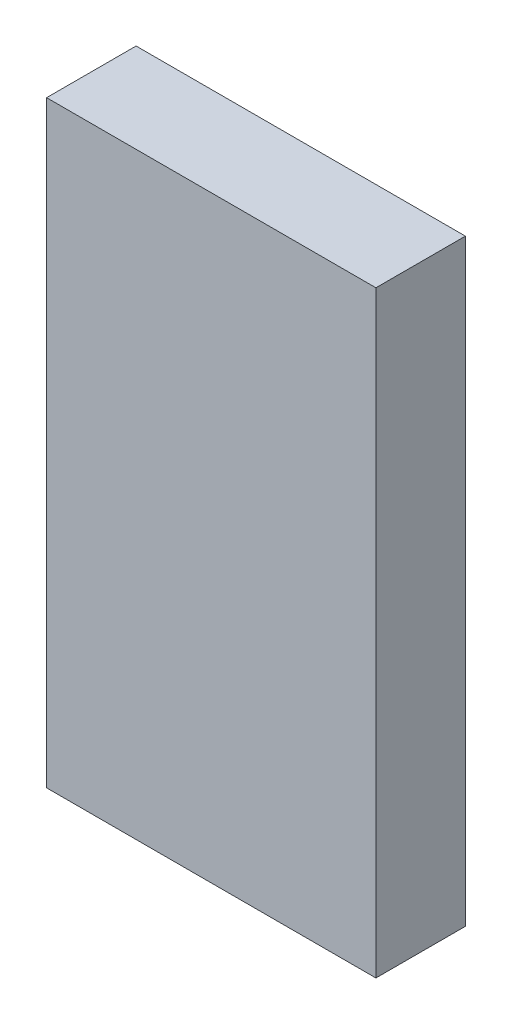
ISO-10303-21;
HEADER;
FILE_DESCRIPTION(('STEP AP214'),'2;1');
FILE_NAME('part.step','',(''),(''),'','','');
FILE_SCHEMA(('AUTOMOTIVE_DESIGN { 1 0 10303 214 1 1 1 1 }'));
ENDSEC;
DATA;
#1=APPLICATION_CONTEXT('core data for automotive mechanical design processes');
#2=APPLICATION_PROTOCOL_DEFINITION('international standard','automotive_design',2000,#1);
#3=PRODUCT_CONTEXT('',#1,'mechanical');
#4=PRODUCT('Part','Part','',(#3));
#5=PRODUCT_RELATED_PRODUCT_CATEGORY('part','',(#4));
#6=PRODUCT_DEFINITION_FORMATION('','',#4);
#7=PRODUCT_DEFINITION_CONTEXT('part definition',#1,'design');
#8=PRODUCT_DEFINITION('design','',#6,#7);
#9=PRODUCT_DEFINITION_SHAPE('','',#8);
#10=(LENGTH_UNIT() NAMED_UNIT(*) SI_UNIT(.MILLI.,.METRE.));
#11=(NAMED_UNIT(*) PLANE_ANGLE_UNIT() SI_UNIT($,.RADIAN.));
#12=(NAMED_UNIT(*) SI_UNIT($,.STERADIAN.) SOLID_ANGLE_UNIT());
#13=UNCERTAINTY_MEASURE_WITH_UNIT(LENGTH_MEASURE(1.E-05),#10,'distance_accuracy_value','');
#14=(GEOMETRIC_REPRESENTATION_CONTEXT(3) GLOBAL_UNCERTAINTY_ASSIGNED_CONTEXT((#13)) GLOBAL_UNIT_ASSIGNED_CONTEXT((#10,
#11,#12)) REPRESENTATION_CONTEXT('',''));
#15=CARTESIAN_POINT('',(0.,0.,0.));
#16=DIRECTION('',(0.,0.,1.));
#17=DIRECTION('',(1.,0.,0.));
#18=AXIS2_PLACEMENT_3D('',#15,#16,#17);
#19=CARTESIAN_POINT('',(0.146,0.771,0.));
#20=DIRECTION('',(1.,0.,0.));
#21=DIRECTION('',(0.,0.,1.));
#22=AXIS2_PLACEMENT_3D('',#19,#20,#21);
#23=PLANE('',#22);
#24=DIRECTION('',(0.,1.,0.));
#25=VECTOR('',#24,1.);
#26=CARTESIAN_POINT('',(0.146,0.771,0.1));
#27=LINE('',#26,#25);
#28=CARTESIAN_POINT('',(0.146,0.771,0.1));
#29=VERTEX_POINT('',#28);
#30=CARTESIAN_POINT('',(0.146,1.439,0.1));
#31=VERTEX_POINT('',#30);
#32=EDGE_CURVE('E11',#29,#31,#27,.T.);
#33=ORIENTED_EDGE('',*,*,#32,.T.);
#34=DIRECTION('',(0.,0.,1.));
#35=VECTOR('',#34,1.);
#36=CARTESIAN_POINT('',(0.146,1.439,0.));
#37=LINE('',#36,#35);
#38=CARTESIAN_POINT('',(0.146,1.439,0.));
#39=VERTEX_POINT('',#38);
#40=EDGE_CURVE('E24',#39,#31,#37,.T.);
#41=ORIENTED_EDGE('',*,*,#40,.F.);
#42=DIRECTION('',(0.,1.,0.));
#43=VECTOR('',#42,1.);
#44=CARTESIAN_POINT('',(0.146,0.771,0.));
#45=LINE('',#44,#43);
#46=CARTESIAN_POINT('',(0.146,0.771,0.));
#47=VERTEX_POINT('',#46);
#48=EDGE_CURVE('E86',#47,#39,#45,.T.);
#49=ORIENTED_EDGE('',*,*,#48,.F.);
#50=DIRECTION('',(0.,0.,1.));
#51=VECTOR('',#50,1.);
#52=CARTESIAN_POINT('',(0.146,0.771,0.));
#53=LINE('',#52,#51);
#54=EDGE_CURVE('E36',#47,#29,#53,.T.);
#55=ORIENTED_EDGE('',*,*,#54,.T.);
#56=EDGE_LOOP('',(#33,#41,#49,#55));
#57=FACE_BOUND('',#56,.T.);
#58=ADVANCED_FACE('F17',(#57),#23,.F.);
#59=CARTESIAN_POINT('',(0.514,0.771,0.));
#60=DIRECTION('',(1.,0.,0.));
#61=DIRECTION('',(0.,0.,1.));
#62=AXIS2_PLACEMENT_3D('',#59,#60,#61);
#63=PLANE('',#62);
#64=DIRECTION('',(0.,0.,1.));
#65=VECTOR('',#64,1.);
#66=CARTESIAN_POINT('',(0.514,0.771,0.));
#67=LINE('',#66,#65);
#68=CARTESIAN_POINT('',(0.514,0.771,0.));
#69=VERTEX_POINT('',#68);
#70=CARTESIAN_POINT('',(0.514,0.771,0.1));
#71=VERTEX_POINT('',#70);
#72=EDGE_CURVE('E83',#69,#71,#67,.T.);
#73=ORIENTED_EDGE('',*,*,#72,.F.);
#74=DIRECTION('',(0.,1.,0.));
#75=VECTOR('',#74,1.);
#76=CARTESIAN_POINT('',(0.514,0.771,0.));
#77=LINE('',#76,#75);
#78=CARTESIAN_POINT('',(0.514,1.439,0.));
#79=VERTEX_POINT('',#78);
#80=EDGE_CURVE('E63',#69,#79,#77,.T.);
#81=ORIENTED_EDGE('',*,*,#80,.T.);
#82=DIRECTION('',(0.,0.,1.));
#83=VECTOR('',#82,1.);
#84=CARTESIAN_POINT('',(0.514,1.439,0.));
#85=LINE('',#84,#83);
#86=CARTESIAN_POINT('',(0.514,1.439,0.1));
#87=VERTEX_POINT('',#86);
#88=EDGE_CURVE('E57',#79,#87,#85,.T.);
#89=ORIENTED_EDGE('',*,*,#88,.T.);
#90=DIRECTION('',(0.,1.,0.));
#91=VECTOR('',#90,1.);
#92=CARTESIAN_POINT('',(0.514,0.771,0.1));
#93=LINE('',#92,#91);
#94=EDGE_CURVE('E60',#71,#87,#93,.T.);
#95=ORIENTED_EDGE('',*,*,#94,.F.);
#96=EDGE_LOOP('',(#73,#81,#89,#95));
#97=FACE_BOUND('',#96,.T.);
#98=ADVANCED_FACE('F59',(#97),#63,.T.);
#99=CARTESIAN_POINT('',(0.146,0.771,0.));
#100=DIRECTION('',(0.,1.,0.));
#101=DIRECTION('',(0.,0.,1.));
#102=AXIS2_PLACEMENT_3D('',#99,#100,#101);
#103=PLANE('',#102);
#104=ORIENTED_EDGE('',*,*,#72,.T.);
#105=DIRECTION('',(1.,0.,0.));
#106=VECTOR('',#105,1.);
#107=CARTESIAN_POINT('',(0.146,0.771,0.1));
#108=LINE('',#107,#106);
#109=EDGE_CURVE('E71',#29,#71,#108,.T.);
#110=ORIENTED_EDGE('',*,*,#109,.F.);
#111=ORIENTED_EDGE('',*,*,#54,.F.);
#112=DIRECTION('',(1.,0.,0.));
#113=VECTOR('',#112,1.);
#114=CARTESIAN_POINT('',(0.146,0.771,0.));
#115=LINE('',#114,#113);
#116=EDGE_CURVE('E76',#47,#69,#115,.T.);
#117=ORIENTED_EDGE('',*,*,#116,.T.);
#118=EDGE_LOOP('',(#104,#110,#111,#117));
#119=FACE_BOUND('',#118,.T.);
#120=ADVANCED_FACE('F91',(#119),#103,.F.);
#121=CARTESIAN_POINT('',(0.146,1.439,0.));
#122=DIRECTION('',(0.,1.,0.));
#123=DIRECTION('',(0.,0.,1.));
#124=AXIS2_PLACEMENT_3D('',#121,#122,#123);
#125=PLANE('',#124);
#126=DIRECTION('',(1.,0.,0.));
#127=VECTOR('',#126,1.);
#128=CARTESIAN_POINT('',(0.146,1.439,0.));
#129=LINE('',#128,#127);
#130=EDGE_CURVE('E74',#39,#79,#129,.T.);
#131=ORIENTED_EDGE('',*,*,#130,.F.);
#132=ORIENTED_EDGE('',*,*,#40,.T.);
#133=DIRECTION('',(1.,0.,0.));
#134=VECTOR('',#133,1.);
#135=CARTESIAN_POINT('',(0.146,1.439,0.1));
#136=LINE('',#135,#134);
#137=EDGE_CURVE('E69',#31,#87,#136,.T.);
#138=ORIENTED_EDGE('',*,*,#137,.T.);
#139=ORIENTED_EDGE('',*,*,#88,.F.);
#140=EDGE_LOOP('',(#131,#132,#138,#139));
#141=FACE_BOUND('',#140,.T.);
#142=ADVANCED_FACE('F73',(#141),#125,.T.);
#143=CARTESIAN_POINT('',(0.146,0.771,0.));
#144=DIRECTION('',(0.,0.,1.));
#145=DIRECTION('',(1.,0.,0.));
#146=AXIS2_PLACEMENT_3D('',#143,#144,#145);
#147=PLANE('',#146);
#148=ORIENTED_EDGE('',*,*,#130,.T.);
#149=ORIENTED_EDGE('',*,*,#80,.F.);
#150=ORIENTED_EDGE('',*,*,#116,.F.);
#151=ORIENTED_EDGE('',*,*,#48,.T.);
#152=EDGE_LOOP('',(#148,#149,#150,#151));
#153=FACE_BOUND('',#152,.T.);
#154=ADVANCED_FACE('F89',(#153),#147,.F.);
#155=CARTESIAN_POINT('',(0.146,0.771,0.1));
#156=DIRECTION('',(0.,0.,1.));
#157=DIRECTION('',(1.,0.,0.));
#158=AXIS2_PLACEMENT_3D('',#155,#156,#157);
#159=PLANE('',#158);
#160=ORIENTED_EDGE('',*,*,#32,.F.);
#161=ORIENTED_EDGE('',*,*,#109,.T.);
#162=ORIENTED_EDGE('',*,*,#94,.T.);
#163=ORIENTED_EDGE('',*,*,#137,.F.);
#164=EDGE_LOOP('',(#160,#161,#162,#163));
#165=FACE_BOUND('',#164,.T.);
#166=ADVANCED_FACE('F68',(#165),#159,.T.);
#167=CLOSED_SHELL('',(#58,#98,#120,#142,#154,#166));
#168=MANIFOLD_SOLID_BREP('B1',#167);
#169=ADVANCED_BREP_SHAPE_REPRESENTATION('',(#18,#168),#14);
#170=SHAPE_DEFINITION_REPRESENTATION(#9,#169);
ENDSEC;
END-ISO-10303-21;
